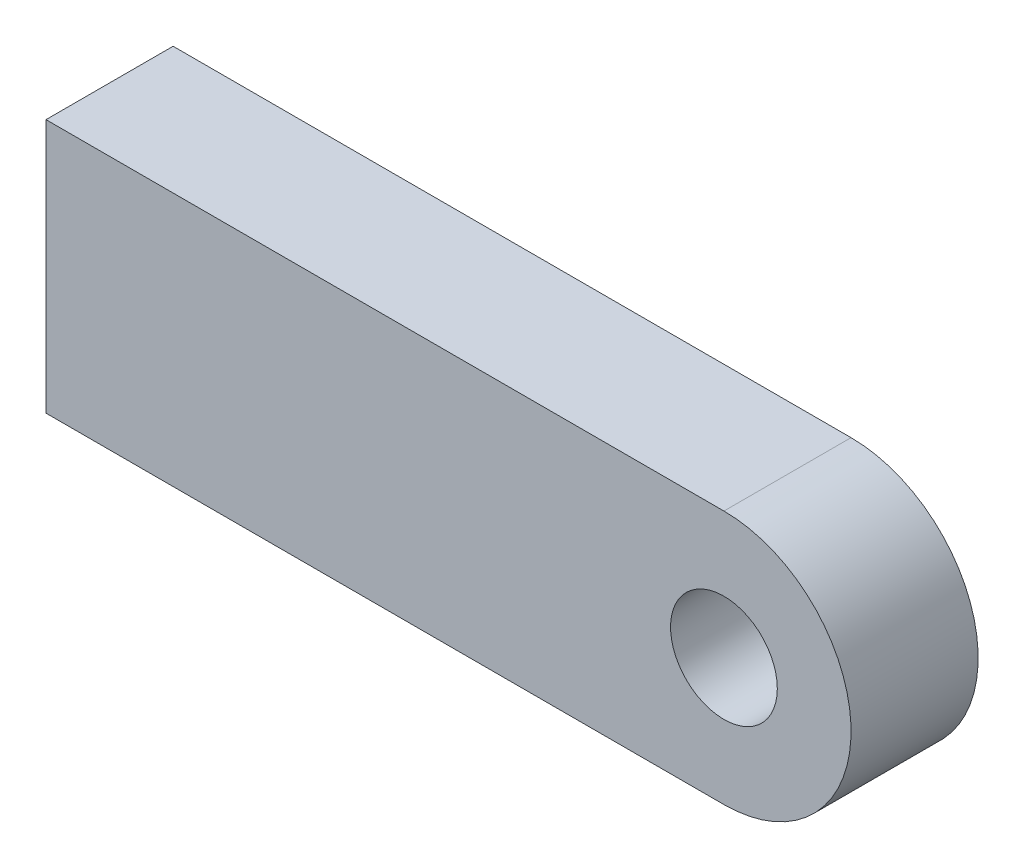
ISO-10303-21;
HEADER;
FILE_DESCRIPTION(('STEP AP214'),'2;1');
FILE_NAME('part.step','',(''),(''),'','','');
FILE_SCHEMA(('AUTOMOTIVE_DESIGN { 1 0 10303 214 1 1 1 1 }'));
ENDSEC;
DATA;
#1=APPLICATION_CONTEXT('core data for automotive mechanical design processes');
#2=APPLICATION_PROTOCOL_DEFINITION('international standard','automotive_design',2000,#1);
#3=PRODUCT_CONTEXT('',#1,'mechanical');
#4=PRODUCT('Part','Part','',(#3));
#5=PRODUCT_RELATED_PRODUCT_CATEGORY('part','',(#4));
#6=PRODUCT_DEFINITION_FORMATION('','',#4);
#7=PRODUCT_DEFINITION_CONTEXT('part definition',#1,'design');
#8=PRODUCT_DEFINITION('design','',#6,#7);
#9=PRODUCT_DEFINITION_SHAPE('','',#8);
#10=(LENGTH_UNIT() NAMED_UNIT(*) SI_UNIT(.MILLI.,.METRE.));
#11=(NAMED_UNIT(*) PLANE_ANGLE_UNIT() SI_UNIT($,.RADIAN.));
#12=(NAMED_UNIT(*) SI_UNIT($,.STERADIAN.) SOLID_ANGLE_UNIT());
#13=UNCERTAINTY_MEASURE_WITH_UNIT(LENGTH_MEASURE(1.E-05),#10,'distance_accuracy_value','');
#14=(GEOMETRIC_REPRESENTATION_CONTEXT(3) GLOBAL_UNCERTAINTY_ASSIGNED_CONTEXT((#13)) GLOBAL_UNIT_ASSIGNED_CONTEXT((#10,
#11,#12)) REPRESENTATION_CONTEXT('',''));
#15=CARTESIAN_POINT('',(0.,0.,0.));
#16=DIRECTION('',(0.,0.,1.));
#17=DIRECTION('',(1.,0.,0.));
#18=AXIS2_PLACEMENT_3D('',#15,#16,#17);
#19=CARTESIAN_POINT('',(175.980244032759,0.,1563.31116284533));
#20=DIRECTION('',(-1.,0.,0.));
#21=DIRECTION('',(0.,0.,1.));
#22=AXIS2_PLACEMENT_3D('',#19,#20,#21);
#23=PLANE('',#22);
#24=DIRECTION('',(0.,0.,1.));
#25=VECTOR('',#24,1.);
#26=CARTESIAN_POINT('',(175.980244032759,607.676596269697,1563.31116284533));
#27=LINE('',#26,#25);
#28=CARTESIAN_POINT('',(175.980244032759,607.676596269697,1563.31116284533));
#29=VERTEX_POINT('',#28);
#30=CARTESIAN_POINT('',(175.980244032759,607.676596269697,1572.83616284533));
#31=VERTEX_POINT('',#30);
#32=EDGE_CURVE('E44',#29,#31,#27,.T.);
#33=ORIENTED_EDGE('',*,*,#32,.T.);
#34=DIRECTION('',(0.,-1.,0.));
#35=VECTOR('',#34,1.);
#36=CARTESIAN_POINT('',(175.980244032759,0.,1572.83616284533));
#37=LINE('',#36,#35);
#38=CARTESIAN_POINT('',(175.980244032759,626.726596269697,1572.83616284533));
#39=VERTEX_POINT('',#38);
#40=EDGE_CURVE('E81',#39,#31,#37,.T.);
#41=ORIENTED_EDGE('',*,*,#40,.F.);
#42=DIRECTION('',(0.,0.,1.));
#43=VECTOR('',#42,1.);
#44=CARTESIAN_POINT('',(175.980244032759,626.726596269697,1563.31116284533));
#45=LINE('',#44,#43);
#46=CARTESIAN_POINT('',(175.980244032759,626.726596269697,1563.31116284533));
#47=VERTEX_POINT('',#46);
#48=EDGE_CURVE('E11',#47,#39,#45,.T.);
#49=ORIENTED_EDGE('',*,*,#48,.F.);
#50=DIRECTION('',(0.,-1.,0.));
#51=VECTOR('',#50,1.);
#52=CARTESIAN_POINT('',(175.980244032759,0.,1563.31116284533));
#53=LINE('',#52,#51);
#54=EDGE_CURVE('E83',#47,#29,#53,.T.);
#55=ORIENTED_EDGE('',*,*,#54,.T.);
#56=EDGE_LOOP('',(#33,#41,#49,#55));
#57=FACE_BOUND('',#56,.T.);
#58=ADVANCED_FACE('F41',(#57),#23,.T.);
#59=CARTESIAN_POINT('',(0.,626.726596269697,1563.31116284533));
#60=DIRECTION('',(0.,-1.,0.));
#61=DIRECTION('',(0.,0.,-1.));
#62=AXIS2_PLACEMENT_3D('',#59,#60,#61);
#63=PLANE('',#62);
#64=ORIENTED_EDGE('',*,*,#48,.T.);
#65=DIRECTION('',(1.,0.,0.));
#66=VECTOR('',#65,1.);
#67=CARTESIAN_POINT('',(0.,626.726596269697,1572.83616284533));
#68=LINE('',#67,#66);
#69=CARTESIAN_POINT('',(226.780244032759,626.726596269697,1572.83616284533));
#70=VERTEX_POINT('',#69);
#71=EDGE_CURVE('E101',#39,#70,#68,.T.);
#72=ORIENTED_EDGE('',*,*,#71,.T.);
#73=DIRECTION('',(0.,0.,1.));
#74=VECTOR('',#73,1.);
#75=CARTESIAN_POINT('',(226.780244032759,626.726596269697,1563.31116284533));
#76=LINE('',#75,#74);
#77=CARTESIAN_POINT('',(226.780244032759,626.726596269697,1563.31116284533));
#78=VERTEX_POINT('',#77);
#79=EDGE_CURVE('E49',#78,#70,#76,.T.);
#80=ORIENTED_EDGE('',*,*,#79,.F.);
#81=DIRECTION('',(1.,0.,0.));
#82=VECTOR('',#81,1.);
#83=CARTESIAN_POINT('',(0.,626.726596269697,1563.31116284533));
#84=LINE('',#83,#82);
#85=EDGE_CURVE('E62',#47,#78,#84,.T.);
#86=ORIENTED_EDGE('',*,*,#85,.F.);
#87=EDGE_LOOP('',(#64,#72,#80,#86));
#88=FACE_BOUND('',#87,.T.);
#89=ADVANCED_FACE('F121',(#88),#63,.F.);
#90=CARTESIAN_POINT('',(226.780244032759,617.201596269697,1563.31116284533));
#91=DIRECTION('',(0.,0.,1.));
#92=DIRECTION('',(1.,0.,0.));
#93=AXIS2_PLACEMENT_3D('',#90,#91,#92);
#94=CYLINDRICAL_SURFACE('',#93,9.52500000000001);
#95=ORIENTED_EDGE('',*,*,#79,.T.);
#96=CARTESIAN_POINT('',(226.780244032759,617.201596269697,1572.83616284533));
#97=DIRECTION('',(0.,0.,1.));
#98=DIRECTION('',(1.,0.,0.));
#99=AXIS2_PLACEMENT_3D('',#96,#97,#98);
#100=CIRCLE('',#99,9.52500000000001);
#101=CARTESIAN_POINT('',(226.780244032759,607.676596269697,1572.83616284533));
#102=VERTEX_POINT('',#101);
#103=EDGE_CURVE('E96',#70,#102,#100,.F.);
#104=ORIENTED_EDGE('',*,*,#103,.T.);
#105=DIRECTION('',(0.,0.,1.));
#106=VECTOR('',#105,1.);
#107=CARTESIAN_POINT('',(226.780244032759,607.676596269697,1563.31116284533));
#108=LINE('',#107,#106);
#109=CARTESIAN_POINT('',(226.780244032759,607.676596269697,1563.31116284533));
#110=VERTEX_POINT('',#109);
#111=EDGE_CURVE('E87',#110,#102,#108,.T.);
#112=ORIENTED_EDGE('',*,*,#111,.F.);
#113=CARTESIAN_POINT('',(226.780244032759,617.201596269697,1563.31116284533));
#114=DIRECTION('',(0.,0.,1.));
#115=DIRECTION('',(1.,0.,0.));
#116=AXIS2_PLACEMENT_3D('',#113,#114,#115);
#117=CIRCLE('',#116,9.52500000000001);
#118=EDGE_CURVE('E112',#78,#110,#117,.F.);
#119=ORIENTED_EDGE('',*,*,#118,.F.);
#120=EDGE_LOOP('',(#95,#104,#112,#119));
#121=FACE_BOUND('',#120,.T.);
#122=ADVANCED_FACE('F119',(#121),#94,.T.);
#123=CARTESIAN_POINT('',(0.,607.676596269697,1563.31116284533));
#124=DIRECTION('',(0.,-1.,0.));
#125=DIRECTION('',(0.,0.,-1.));
#126=AXIS2_PLACEMENT_3D('',#123,#124,#125);
#127=PLANE('',#126);
#128=ORIENTED_EDGE('',*,*,#111,.T.);
#129=DIRECTION('',(1.,0.,0.));
#130=VECTOR('',#129,1.);
#131=CARTESIAN_POINT('',(0.,607.676596269697,1572.83616284533));
#132=LINE('',#131,#130);
#133=EDGE_CURVE('E90',#31,#102,#132,.T.);
#134=ORIENTED_EDGE('',*,*,#133,.F.);
#135=ORIENTED_EDGE('',*,*,#32,.F.);
#136=DIRECTION('',(1.,0.,0.));
#137=VECTOR('',#136,1.);
#138=CARTESIAN_POINT('',(0.,607.676596269697,1563.31116284533));
#139=LINE('',#138,#137);
#140=EDGE_CURVE('E110',#29,#110,#139,.T.);
#141=ORIENTED_EDGE('',*,*,#140,.T.);
#142=EDGE_LOOP('',(#128,#134,#135,#141));
#143=FACE_BOUND('',#142,.T.);
#144=ADVANCED_FACE('F91',(#143),#127,.T.);
#145=CARTESIAN_POINT('',(226.780244032759,617.201596269697,1563.31116284533));
#146=DIRECTION('',(0.,0.,1.));
#147=DIRECTION('',(1.,0.,0.));
#148=AXIS2_PLACEMENT_3D('',#145,#146,#147);
#149=CYLINDRICAL_SURFACE('',#148,4.00000000000002);
#150=CARTESIAN_POINT('',(226.780244032759,617.201596269697,1563.31116284533));
#151=DIRECTION('',(0.,0.,1.));
#152=DIRECTION('',(1.,0.,0.));
#153=AXIS2_PLACEMENT_3D('',#150,#151,#152);
#154=CIRCLE('',#153,4.00000000000002);
#155=CARTESIAN_POINT('',(230.780244032759,617.201596269697,1563.31116284533));
#156=VERTEX_POINT('',#155);
#157=EDGE_CURVE('E88',#156,#156,#154,.T.);
#158=ORIENTED_EDGE('',*,*,#157,.F.);
#159=EDGE_LOOP('',(#158));
#160=FACE_BOUND('',#159,.T.);
#161=CARTESIAN_POINT('',(226.780244032759,617.201596269697,1572.83616284533));
#162=DIRECTION('',(0.,0.,1.));
#163=DIRECTION('',(1.,0.,0.));
#164=AXIS2_PLACEMENT_3D('',#161,#162,#163);
#165=CIRCLE('',#164,4.00000000000002);
#166=CARTESIAN_POINT('',(230.780244032759,617.201596269697,1572.83616284533));
#167=VERTEX_POINT('',#166);
#168=EDGE_CURVE('E106',#167,#167,#165,.T.);
#169=ORIENTED_EDGE('',*,*,#168,.T.);
#170=EDGE_LOOP('',(#169));
#171=FACE_BOUND('',#170,.T.);
#172=ADVANCED_FACE('F125',(#160,#171),#149,.F.);
#173=CARTESIAN_POINT('',(0.,0.,1563.31116284533));
#174=DIRECTION('',(0.,0.,1.));
#175=DIRECTION('',(1.,0.,0.));
#176=AXIS2_PLACEMENT_3D('',#173,#174,#175);
#177=PLANE('',#176);
#178=ORIENTED_EDGE('',*,*,#54,.F.);
#179=ORIENTED_EDGE('',*,*,#85,.T.);
#180=ORIENTED_EDGE('',*,*,#118,.T.);
#181=ORIENTED_EDGE('',*,*,#140,.F.);
#182=EDGE_LOOP('',(#178,#179,#180,#181));
#183=FACE_BOUND('',#182,.T.);
#184=ORIENTED_EDGE('',*,*,#157,.T.);
#185=EDGE_LOOP('',(#184));
#186=FACE_BOUND('',#185,.T.);
#187=ADVANCED_FACE('F122',(#183,#186),#177,.F.);
#188=CARTESIAN_POINT('',(0.,0.,1572.83616284533));
#189=DIRECTION('',(0.,0.,1.));
#190=DIRECTION('',(1.,0.,0.));
#191=AXIS2_PLACEMENT_3D('',#188,#189,#190);
#192=PLANE('',#191);
#193=ORIENTED_EDGE('',*,*,#40,.T.);
#194=ORIENTED_EDGE('',*,*,#133,.T.);
#195=ORIENTED_EDGE('',*,*,#103,.F.);
#196=ORIENTED_EDGE('',*,*,#71,.F.);
#197=EDGE_LOOP('',(#193,#194,#195,#196));
#198=FACE_BOUND('',#197,.T.);
#199=ORIENTED_EDGE('',*,*,#168,.F.);
#200=EDGE_LOOP('',(#199));
#201=FACE_BOUND('',#200,.T.);
#202=ADVANCED_FACE('F98',(#198,#201),#192,.T.);
#203=CLOSED_SHELL('',(#58,#89,#122,#144,#172,#187,#202));
#204=MANIFOLD_SOLID_BREP('B2',#203);
#205=ADVANCED_BREP_SHAPE_REPRESENTATION('',(#18,#204),#14);
#206=SHAPE_DEFINITION_REPRESENTATION(#9,#205);
ENDSEC;
END-ISO-10303-21;
